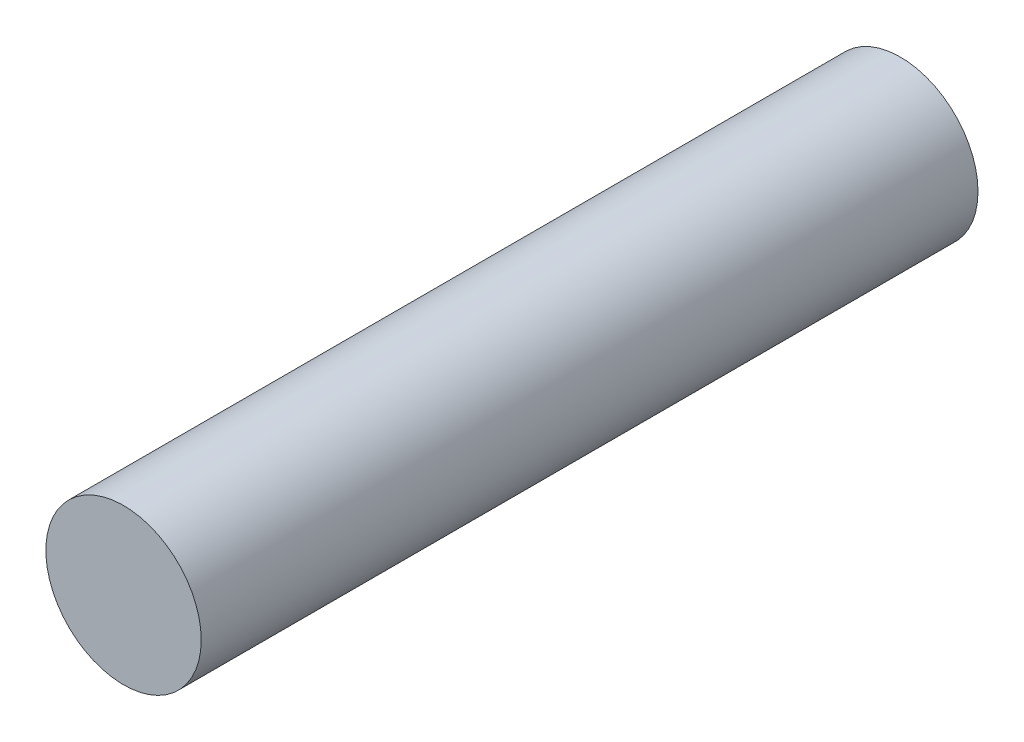
ISO-10303-21;
HEADER;
FILE_DESCRIPTION(('STEP AP214'),'2;1');
FILE_NAME('part.step','',(''),(''),'','','');
FILE_SCHEMA(('AUTOMOTIVE_DESIGN { 1 0 10303 214 1 1 1 1 }'));
ENDSEC;
DATA;
#1=APPLICATION_CONTEXT('core data for automotive mechanical design processes');
#2=APPLICATION_PROTOCOL_DEFINITION('international standard','automotive_design',2000,#1);
#3=PRODUCT_CONTEXT('',#1,'mechanical');
#4=PRODUCT('Part','Part','',(#3));
#5=PRODUCT_RELATED_PRODUCT_CATEGORY('part','',(#4));
#6=PRODUCT_DEFINITION_FORMATION('','',#4);
#7=PRODUCT_DEFINITION_CONTEXT('part definition',#1,'design');
#8=PRODUCT_DEFINITION('design','',#6,#7);
#9=PRODUCT_DEFINITION_SHAPE('','',#8);
#10=(LENGTH_UNIT() NAMED_UNIT(*) SI_UNIT(.MILLI.,.METRE.));
#11=(NAMED_UNIT(*) PLANE_ANGLE_UNIT() SI_UNIT($,.RADIAN.));
#12=(NAMED_UNIT(*) SI_UNIT($,.STERADIAN.) SOLID_ANGLE_UNIT());
#13=UNCERTAINTY_MEASURE_WITH_UNIT(LENGTH_MEASURE(1.E-05),#10,'distance_accuracy_value','');
#14=(GEOMETRIC_REPRESENTATION_CONTEXT(3) GLOBAL_UNCERTAINTY_ASSIGNED_CONTEXT((#13)) GLOBAL_UNIT_ASSIGNED_CONTEXT((#10,
#11,#12)) REPRESENTATION_CONTEXT('',''));
#15=CARTESIAN_POINT('',(0.,0.,0.));
#16=DIRECTION('',(0.,0.,1.));
#17=DIRECTION('',(1.,0.,0.));
#18=AXIS2_PLACEMENT_3D('',#15,#16,#17);
#19=CARTESIAN_POINT('',(0.884706705505724,2.56754438242862,15.));
#20=DIRECTION('',(0.,0.,-1.));
#21=DIRECTION('',(-1.,0.,0.));
#22=AXIS2_PLACEMENT_3D('',#19,#20,#21);
#23=CYLINDRICAL_SURFACE('',#22,1.5);
#24=CARTESIAN_POINT('',(0.884706705505724,2.56754438242862,15.));
#25=DIRECTION('',(0.,0.,1.));
#26=DIRECTION('',(1.,0.,0.));
#27=AXIS2_PLACEMENT_3D('',#24,#25,#26);
#28=CIRCLE('',#27,1.5);
#29=CARTESIAN_POINT('',(2.38470670550572,2.56754438242862,15.));
#30=VERTEX_POINT('',#29);
#31=EDGE_CURVE('E10',#30,#30,#28,.T.);
#32=ORIENTED_EDGE('',*,*,#31,.F.);
#33=EDGE_LOOP('',(#32));
#34=FACE_BOUND('',#33,.T.);
#35=CARTESIAN_POINT('',(0.884706705505724,2.56754438242862,0.));
#36=DIRECTION('',(0.,0.,1.));
#37=DIRECTION('',(1.,0.,0.));
#38=AXIS2_PLACEMENT_3D('',#35,#36,#37);
#39=CIRCLE('',#38,1.5);
#40=CARTESIAN_POINT('',(2.38470670550572,2.56754438242862,0.));
#41=VERTEX_POINT('',#40);
#42=EDGE_CURVE('E34',#41,#41,#39,.T.);
#43=ORIENTED_EDGE('',*,*,#42,.T.);
#44=EDGE_LOOP('',(#43));
#45=FACE_BOUND('',#44,.T.);
#46=ADVANCED_FACE('F31',(#34,#45),#23,.T.);
#47=CARTESIAN_POINT('',(0.884706705505724,2.56754438242862,15.));
#48=DIRECTION('',(0.,0.,1.));
#49=DIRECTION('',(1.,0.,0.));
#50=AXIS2_PLACEMENT_3D('',#47,#48,#49);
#51=PLANE('',#50);
#52=ORIENTED_EDGE('',*,*,#31,.T.);
#53=EDGE_LOOP('',(#52));
#54=FACE_BOUND('',#53,.T.);
#55=ADVANCED_FACE('F46',(#54),#51,.T.);
#56=CARTESIAN_POINT('',(0.884706705505724,2.56754438242862,0.));
#57=DIRECTION('',(0.,0.,1.));
#58=DIRECTION('',(1.,0.,0.));
#59=AXIS2_PLACEMENT_3D('',#56,#57,#58);
#60=PLANE('',#59);
#61=ORIENTED_EDGE('',*,*,#42,.F.);
#62=EDGE_LOOP('',(#61));
#63=FACE_BOUND('',#62,.T.);
#64=ADVANCED_FACE('F44',(#63),#60,.F.);
#65=CLOSED_SHELL('',(#46,#55,#64));
#66=MANIFOLD_SOLID_BREP('B2',#65);
#67=ADVANCED_BREP_SHAPE_REPRESENTATION('',(#18,#66),#14);
#68=SHAPE_DEFINITION_REPRESENTATION(#9,#67);
ENDSEC;
END-ISO-10303-21;
